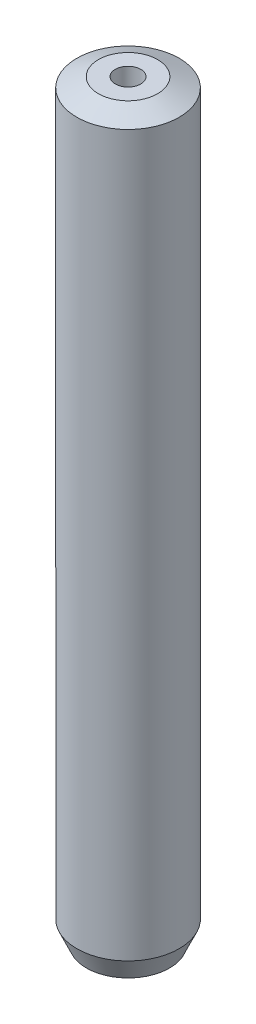
ISO-10303-21;
HEADER;
FILE_DESCRIPTION(('STEP AP214'),'2;1');
FILE_NAME('part.step','',(''),(''),'','','');
FILE_SCHEMA(('AUTOMOTIVE_DESIGN { 1 0 10303 214 1 1 1 1 }'));
ENDSEC;
DATA;
#1=APPLICATION_CONTEXT('core data for automotive mechanical design processes');
#2=APPLICATION_PROTOCOL_DEFINITION('international standard','automotive_design',2000,#1);
#3=PRODUCT_CONTEXT('',#1,'mechanical');
#4=PRODUCT('Part','Part','',(#3));
#5=PRODUCT_RELATED_PRODUCT_CATEGORY('part','',(#4));
#6=PRODUCT_DEFINITION_FORMATION('','',#4);
#7=PRODUCT_DEFINITION_CONTEXT('part definition',#1,'design');
#8=PRODUCT_DEFINITION('design','',#6,#7);
#9=PRODUCT_DEFINITION_SHAPE('','',#8);
#10=(LENGTH_UNIT() NAMED_UNIT(*) SI_UNIT(.MILLI.,.METRE.));
#11=(NAMED_UNIT(*) PLANE_ANGLE_UNIT() SI_UNIT($,.RADIAN.));
#12=(NAMED_UNIT(*) SI_UNIT($,.STERADIAN.) SOLID_ANGLE_UNIT());
#13=UNCERTAINTY_MEASURE_WITH_UNIT(LENGTH_MEASURE(1.E-05),#10,'distance_accuracy_value','');
#14=(GEOMETRIC_REPRESENTATION_CONTEXT(3) GLOBAL_UNCERTAINTY_ASSIGNED_CONTEXT((#13)) GLOBAL_UNIT_ASSIGNED_CONTEXT((#10,
#11,#12)) REPRESENTATION_CONTEXT('',''));
#15=CARTESIAN_POINT('',(0.,0.,0.));
#16=DIRECTION('',(0.,0.,1.));
#17=DIRECTION('',(1.,0.,0.));
#18=AXIS2_PLACEMENT_3D('',#15,#16,#17);
#19=CARTESIAN_POINT('',(0.,110.110370823984,0.));
#20=DIRECTION('',(0.,-1.,0.));
#21=DIRECTION('',(0.,0.,-1.));
#22=AXIS2_PLACEMENT_3D('',#19,#20,#21);
#23=CYLINDRICAL_SURFACE('',#22,7.5);
#24=CARTESIAN_POINT('',(0.,108.703090389656,0.));
#25=DIRECTION('',(0.,1.,0.));
#26=DIRECTION('',(0.,0.,1.));
#27=AXIS2_PLACEMENT_3D('',#24,#25,#26);
#28=CIRCLE('',#27,7.5);
#29=CARTESIAN_POINT('',(0.,108.703090389656,-7.5));
#30=VERTEX_POINT('',#29);
#31=EDGE_CURVE('E50',#30,#30,#28,.F.);
#32=CARTESIAN_POINT('',(0.,3.16153176313021,0.));
#33=DIRECTION('',(0.,1.,0.));
#34=DIRECTION('',(0.,0.,1.));
#35=AXIS2_PLACEMENT_3D('',#32,#33,#34);
#36=CIRCLE('',#35,7.5);
#37=CARTESIAN_POINT('',(0.,3.16153176313021,-7.5));
#38=VERTEX_POINT('',#37);
#39=EDGE_CURVE('E51',#38,#38,#36,.T.);
#40=CARTESIAN_POINT('',(0.,108.703090389656,-7.5));
#41=CARTESIAN_POINT('',(0.,107.603699153963,-7.5));
#42=CARTESIAN_POINT('',(0.,106.50430791827,-7.5));
#43=CARTESIAN_POINT('',(0.,104.305525446884,-7.5));
#44=CARTESIAN_POINT('',(0.,103.206134211191,-7.5));
#45=CARTESIAN_POINT('',(0.,101.007351739805,-7.5));
#46=CARTESIAN_POINT('',(0.,99.9079605041123,-7.5));
#47=CARTESIAN_POINT('',(0.,97.7091780327263,-7.5));
#48=CARTESIAN_POINT('',(0.,96.6097867970334,-7.5));
#49=CARTESIAN_POINT('',(0.,94.4110043256474,-7.5));
#50=CARTESIAN_POINT('',(0.,93.3116130899544,-7.5));
#51=CARTESIAN_POINT('',(0.,91.1128306185685,-7.5));
#52=CARTESIAN_POINT('',(0.,90.0134393828755,-7.5));
#53=CARTESIAN_POINT('',(0.,87.8146569114895,-7.5));
#54=CARTESIAN_POINT('',(0.,86.7152656757966,-7.5));
#55=CARTESIAN_POINT('',(0.,84.5164832044106,-7.5));
#56=CARTESIAN_POINT('',(0.,83.4170919687176,-7.5));
#57=CARTESIAN_POINT('',(0.,81.2183094973317,-7.5));
#58=CARTESIAN_POINT('',(0.,80.1189182616387,-7.5));
#59=CARTESIAN_POINT('',(0.,77.9201357902527,-7.5));
#60=CARTESIAN_POINT('',(0.,76.8207445545598,-7.5));
#61=CARTESIAN_POINT('',(0.,74.6219620831738,-7.5));
#62=CARTESIAN_POINT('',(0.,73.5225708474808,-7.5));
#63=CARTESIAN_POINT('',(0.,71.3237883760949,-7.5));
#64=CARTESIAN_POINT('',(0.,70.2243971404019,-7.5));
#65=CARTESIAN_POINT('',(0.,68.0256146690159,-7.5));
#66=CARTESIAN_POINT('',(0.,66.926223433323,-7.5));
#67=CARTESIAN_POINT('',(0.,64.727440961937,-7.5));
#68=CARTESIAN_POINT('',(0.,63.628049726244,-7.5));
#69=CARTESIAN_POINT('',(0.,61.4292672548581,-7.5));
#70=CARTESIAN_POINT('',(0.,60.3298760191651,-7.5));
#71=CARTESIAN_POINT('',(0.,58.1310935477791,-7.5));
#72=CARTESIAN_POINT('',(0.,57.0317023120861,-7.5));
#73=CARTESIAN_POINT('',(0.,54.8329198407002,-7.5));
#74=CARTESIAN_POINT('',(0.,53.7335286050072,-7.5));
#75=CARTESIAN_POINT('',(0.,51.5347461336213,-7.5));
#76=CARTESIAN_POINT('',(0.,50.4353548979283,-7.5));
#77=CARTESIAN_POINT('',(0.,48.2365724265423,-7.5));
#78=CARTESIAN_POINT('',(0.,47.1371811908493,-7.5));
#79=CARTESIAN_POINT('',(0.,44.9383987194634,-7.5));
#80=CARTESIAN_POINT('',(0.,43.8390074837704,-7.5));
#81=CARTESIAN_POINT('',(0.,41.6402250123845,-7.5));
#82=CARTESIAN_POINT('',(0.,40.5408337766915,-7.5));
#83=CARTESIAN_POINT('',(0.,38.3420513053055,-7.5));
#84=CARTESIAN_POINT('',(0.,37.2426600696125,-7.5));
#85=CARTESIAN_POINT('',(0.,35.0438775982266,-7.5));
#86=CARTESIAN_POINT('',(0.,33.9444863625336,-7.5));
#87=CARTESIAN_POINT('',(0.,31.7457038911476,-7.5));
#88=CARTESIAN_POINT('',(0.,30.6463126554547,-7.5));
#89=CARTESIAN_POINT('',(0.,28.4475301840687,-7.5));
#90=CARTESIAN_POINT('',(0.,27.3481389483757,-7.5));
#91=CARTESIAN_POINT('',(0.,25.1493564769898,-7.5));
#92=CARTESIAN_POINT('',(0.,24.0499652412968,-7.5));
#93=CARTESIAN_POINT('',(0.,21.8511827699108,-7.5));
#94=CARTESIAN_POINT('',(0.,20.7517915342179,-7.5));
#95=CARTESIAN_POINT('',(0.,18.5530090628319,-7.5));
#96=CARTESIAN_POINT('',(0.,17.4536178271389,-7.5));
#97=CARTESIAN_POINT('',(0.,15.254835355753,-7.5));
#98=CARTESIAN_POINT('',(0.,14.15544412006,-7.5));
#99=CARTESIAN_POINT('',(0.,11.956661648674,-7.5));
#100=CARTESIAN_POINT('',(0.,10.8572704129811,-7.5));
#101=CARTESIAN_POINT('',(0.,8.65848794159511,-7.5));
#102=CARTESIAN_POINT('',(0.,7.55909670590213,-7.5));
#103=CARTESIAN_POINT('',(0.,5.36031423451617,-7.5));
#104=CARTESIAN_POINT('',(0.,4.26092299882318,-7.5));
#105=CARTESIAN_POINT('',(0.,3.16153176313021,-7.5));
#106=B_SPLINE_CURVE_WITH_KNOTS('',3,(#40,#41,#42,#43,#44,#45,#46,#47,#48,#49,#50,#51,#52,#53,
#54,#55,#56,#57,#58,#59,#60,#61,#62,#63,#64,#65,#66,#67,#68,#69,#70,#71,#72,#73,#74,#75,#76,#77,
#78,#79,#80,#81,#82,#83,#84,#85,#86,#87,#88,#89,#90,#91,#92,#93,#94,#95,#96,#97,#98,#99,#100,
#101,#102,#103,#104,#105),.UNSPECIFIED.,.F.,.F.,(4,2,2,2,2,2,2,2,2,2,2,2,2,2,2,2,2,2,2,2,2,2,2,
2,2,2,2,2,2,2,2,2,4),(0.,3.29817370707894,6.59634741415788,9.89452112123682,13.1926948283157,
16.4908685353947,19.7890422424736,23.0872159495526,26.3853896566315,29.6835633637104,
32.9817370707893,36.2799107778683,39.5780844849472,42.8762581920262,46.1744318991051,
49.472605606184,52.770779313263,56.0689530203419,59.3671267274208,62.6653004344997,
65.9634741415787,69.2616478486576,72.5598215557366,75.8579952628155,79.1561689698944,
82.4543426769734,85.7525163840523,89.0506900911312,92.3488637982102,95.6470375052891,
98.9452112123681,102.243384919447,105.541558626526),.UNSPECIFIED.);
#107=EDGE_CURVE('BSEAM39',#30,#38,#106,.T.);
#108=ORIENTED_EDGE('',*,*,#31,.T.);
#109=ORIENTED_EDGE('',*,*,#39,.T.);
#110=ORIENTED_EDGE('',*,*,#107,.T.);
#111=ORIENTED_EDGE('',*,*,#107,.F.);
#112=EDGE_LOOP('',(#108,#110,#109,#111));
#113=FACE_BOUND('',#112,.T.);
#114=ADVANCED_FACE('F39',(#113),#23,.T.);
#115=CARTESIAN_POINT('',(0.,110.110370823984,0.));
#116=DIRECTION('',(0.,1.,0.));
#117=DIRECTION('',(0.,0.,1.));
#118=AXIS2_PLACEMENT_3D('',#115,#116,#117);
#119=PLANE('',#118);
#120=CARTESIAN_POINT('',(0.,110.110370823984,0.));
#121=DIRECTION('',(0.,1.,0.));
#122=DIRECTION('',(0.,0.,1.));
#123=AXIS2_PLACEMENT_3D('',#120,#121,#122);
#124=CIRCLE('',#123,4.33846823687019);
#125=CARTESIAN_POINT('',(0.,110.110370823984,4.33846823687019));
#126=VERTEX_POINT('',#125);
#127=EDGE_CURVE('E54',#126,#126,#124,.T.);
#128=ORIENTED_EDGE('',*,*,#127,.T.);
#129=EDGE_LOOP('',(#128));
#130=FACE_BOUND('',#129,.T.);
#131=CARTESIAN_POINT('',(0.,110.110370823984,0.));
#132=DIRECTION('',(0.,1.,0.));
#133=DIRECTION('',(0.,0.,1.));
#134=AXIS2_PLACEMENT_3D('',#131,#132,#133);
#135=CIRCLE('',#134,1.86861629184657);
#136=CARTESIAN_POINT('',(0.,110.110370823984,-1.86861629184657));
#137=VERTEX_POINT('',#136);
#138=EDGE_CURVE('E58',#137,#137,#135,.T.);
#139=ORIENTED_EDGE('',*,*,#138,.F.);
#140=EDGE_LOOP('',(#139));
#141=FACE_BOUND('',#140,.T.);
#142=ADVANCED_FACE('F69',(#130,#141),#119,.T.);
#143=CARTESIAN_POINT('',(0.,0.,0.));
#144=DIRECTION('',(0.,1.,0.));
#145=DIRECTION('',(0.,0.,1.));
#146=AXIS2_PLACEMENT_3D('',#143,#144,#145);
#147=PLANE('',#146);
#148=CARTESIAN_POINT('',(0.,0.,0.));
#149=DIRECTION('',(0.,1.,0.));
#150=DIRECTION('',(0.,0.,1.));
#151=AXIS2_PLACEMENT_3D('',#148,#149,#150);
#152=CIRCLE('',#151,6.09271956567148);
#153=CARTESIAN_POINT('',(0.,0.,6.09271956567148));
#154=VERTEX_POINT('',#153);
#155=EDGE_CURVE('E10',#154,#154,#152,.F.);
#156=ORIENTED_EDGE('',*,*,#155,.T.);
#157=EDGE_LOOP('',(#156));
#158=FACE_BOUND('',#157,.T.);
#159=CARTESIAN_POINT('',(0.,0.,0.));
#160=DIRECTION('',(0.,1.,0.));
#161=DIRECTION('',(0.,0.,1.));
#162=AXIS2_PLACEMENT_3D('',#159,#160,#161);
#163=CIRCLE('',#162,1.86861629184657);
#164=CARTESIAN_POINT('',(0.,0.,-1.86861629184657));
#165=VERTEX_POINT('',#164);
#166=EDGE_CURVE('E63',#165,#165,#163,.T.);
#167=ORIENTED_EDGE('',*,*,#166,.T.);
#168=EDGE_LOOP('',(#167));
#169=FACE_BOUND('',#168,.T.);
#170=ADVANCED_FACE('F75',(#158,#169),#147,.F.);
#171=CARTESIAN_POINT('',(0.,110.110370823984,0.));
#172=DIRECTION('',(0.,-1.,0.));
#173=DIRECTION('',(0.,0.,-1.));
#174=AXIS2_PLACEMENT_3D('',#171,#172,#173);
#175=CYLINDRICAL_SURFACE('',#174,1.86861629184657);
#176=CARTESIAN_POINT('',(0.,110.110370823984,-1.86861629184657));
#177=CARTESIAN_POINT('',(0.,108.963387794568,-1.86861629184657));
#178=CARTESIAN_POINT('',(0.,107.816404765151,-1.86861629184657));
#179=CARTESIAN_POINT('',(0.,105.522438706318,-1.86861629184657));
#180=CARTESIAN_POINT('',(0.,104.375455676902,-1.86861629184657));
#181=CARTESIAN_POINT('',(0.,102.081489618069,-1.86861629184657));
#182=CARTESIAN_POINT('',(0.,100.934506588652,-1.86861629184657));
#183=CARTESIAN_POINT('',(0.,98.6405405298194,-1.86861629184657));
#184=CARTESIAN_POINT('',(0.,97.4935575004029,-1.86861629184657));
#185=CARTESIAN_POINT('',(0.,95.1995914415699,-1.86861629184657));
#186=CARTESIAN_POINT('',(0.,94.0526084121534,-1.86861629184657));
#187=CARTESIAN_POINT('',(0.,91.7586423533204,-1.86861629184657));
#188=CARTESIAN_POINT('',(0.,90.6116593239039,-1.86861629184657));
#189=CARTESIAN_POINT('',(0.,88.3176932650709,-1.86861629184657));
#190=CARTESIAN_POINT('',(0.,87.1707102356544,-1.86861629184657));
#191=CARTESIAN_POINT('',(0.,84.8767441768214,-1.86861629184657));
#192=CARTESIAN_POINT('',(0.,83.7297611474049,-1.86861629184657));
#193=CARTESIAN_POINT('',(0.,81.4357950885719,-1.86861629184657));
#194=CARTESIAN_POINT('',(0.,80.2888120591553,-1.86861629184657));
#195=CARTESIAN_POINT('',(0.,77.9948460003223,-1.86861629184657));
#196=CARTESIAN_POINT('',(0.,76.8478629709058,-1.86861629184657));
#197=CARTESIAN_POINT('',(0.,74.5538969120728,-1.86861629184657));
#198=CARTESIAN_POINT('',(0.,73.4069138826563,-1.86861629184657));
#199=CARTESIAN_POINT('',(0.,71.1129478238233,-1.86861629184657));
#200=CARTESIAN_POINT('',(0.,69.9659647944068,-1.86861629184657));
#201=CARTESIAN_POINT('',(0.,67.6719987355738,-1.86861629184657));
#202=CARTESIAN_POINT('',(0.,66.5250157061573,-1.86861629184657));
#203=CARTESIAN_POINT('',(0.,64.2310496473243,-1.86861629184657));
#204=CARTESIAN_POINT('',(0.,63.0840666179078,-1.86861629184657));
#205=CARTESIAN_POINT('',(0.,60.7901005590748,-1.86861629184657));
#206=CARTESIAN_POINT('',(0.,59.6431175296582,-1.86861629184657));
#207=CARTESIAN_POINT('',(0.,57.3491514708252,-1.86861629184657));
#208=CARTESIAN_POINT('',(0.,56.2021684414087,-1.86861629184657));
#209=CARTESIAN_POINT('',(0.,53.9082023825757,-1.86861629184657));
#210=CARTESIAN_POINT('',(0.,52.7612193531592,-1.86861629184657));
#211=CARTESIAN_POINT('',(0.,50.4672532943262,-1.86861629184657));
#212=CARTESIAN_POINT('',(0.,49.3202702649097,-1.86861629184657));
#213=CARTESIAN_POINT('',(0.,47.0263042060767,-1.86861629184657));
#214=CARTESIAN_POINT('',(0.,45.8793211766602,-1.86861629184657));
#215=CARTESIAN_POINT('',(0.,43.5853551178272,-1.86861629184657));
#216=CARTESIAN_POINT('',(0.,42.4383720884107,-1.86861629184657));
#217=CARTESIAN_POINT('',(0.,40.1444060295777,-1.86861629184657));
#218=CARTESIAN_POINT('',(0.,38.9974230001612,-1.86861629184657));
#219=CARTESIAN_POINT('',(0.,36.7034569413282,-1.86861629184657));
#220=CARTESIAN_POINT('',(0.,35.5564739119117,-1.86861629184657));
#221=CARTESIAN_POINT('',(0.,33.2625078530786,-1.86861629184657));
#222=CARTESIAN_POINT('',(0.,32.1155248236621,-1.86861629184657));
#223=CARTESIAN_POINT('',(0.,29.8215587648291,-1.86861629184657));
#224=CARTESIAN_POINT('',(0.,28.6745757354126,-1.86861629184657));
#225=CARTESIAN_POINT('',(0.,26.3806096765796,-1.86861629184657));
#226=CARTESIAN_POINT('',(0.,25.2336266471631,-1.86861629184657));
#227=CARTESIAN_POINT('',(0.,22.9396605883301,-1.86861629184657));
#228=CARTESIAN_POINT('',(0.,21.7926775589136,-1.86861629184657));
#229=CARTESIAN_POINT('',(0.,19.4987115000806,-1.86861629184657));
#230=CARTESIAN_POINT('',(0.,18.3517284706641,-1.86861629184657));
#231=CARTESIAN_POINT('',(0.,16.0577624118311,-1.86861629184657));
#232=CARTESIAN_POINT('',(0.,14.9107793824146,-1.86861629184657));
#233=CARTESIAN_POINT('',(0.,12.6168133235815,-1.86861629184657));
#234=CARTESIAN_POINT('',(0.,11.469830294165,-1.86861629184657));
#235=CARTESIAN_POINT('',(0.,9.17586423533203,-1.86861629184657));
#236=CARTESIAN_POINT('',(0.,8.02888120591553,-1.86861629184657));
#237=CARTESIAN_POINT('',(0.,5.73491514708252,-1.86861629184657));
#238=CARTESIAN_POINT('',(0.,4.58793211766601,-1.86861629184657));
#239=CARTESIAN_POINT('',(0.,2.293966058833,-1.86861629184657));
#240=CARTESIAN_POINT('',(0.,1.14698302941649,-1.86861629184657));
#241=CARTESIAN_POINT('',(0.,0.,-1.86861629184657));
#242=B_SPLINE_CURVE_WITH_KNOTS('',3,(#176,#177,#178,#179,#180,#181,#182,#183,#184,#185,#186,
#187,#188,#189,#190,#191,#192,#193,#194,#195,#196,#197,#198,#199,#200,#201,#202,#203,#204,#205,
#206,#207,#208,#209,#210,#211,#212,#213,#214,#215,#216,#217,#218,#219,#220,#221,#222,#223,#224,
#225,#226,#227,#228,#229,#230,#231,#232,#233,#234,#235,#236,#237,#238,#239,#240,#241),
.UNSPECIFIED.,.F.,.F.,(4,2,2,2,2,2,2,2,2,2,2,2,2,2,2,2,2,2,2,2,2,2,2,2,2,2,2,2,2,2,2,2,4),(0.,
3.44094908824952,6.88189817649904,10.3228472647486,13.7637963529981,17.2047454412476,
20.6456945294971,24.0866436177466,27.5275927059961,30.9685417942456,34.4094908824952,
37.8504399707447,41.2913890589942,44.7323381472437,48.1732872354932,51.6142363237427,
55.0551854119923,58.4961345002418,61.9370835884913,65.3780326767408,68.8189817649903,
72.2599308532398,75.7008799414893,79.1418290297388,82.5827781179884,86.0237272062379,
89.4646762944874,92.9056253827369,96.3465744709864,99.7875235592359,103.228472647485,
106.669421735735,110.110370823984),.UNSPECIFIED.);
#243=EDGE_CURVE('BSEAM70',#137,#165,#242,.T.);
#244=ORIENTED_EDGE('',*,*,#138,.T.);
#245=ORIENTED_EDGE('',*,*,#166,.F.);
#246=ORIENTED_EDGE('',*,*,#243,.T.);
#247=ORIENTED_EDGE('',*,*,#243,.F.);
#248=EDGE_LOOP('',(#244,#246,#245,#247));
#249=FACE_BOUND('',#248,.T.);
#250=ADVANCED_FACE('F70',(#249),#175,.F.);
#251=CARTESIAN_POINT('',(0.,110.110370823984,0.));
#252=DIRECTION('',(0.,-1.,0.));
#253=DIRECTION('',(0.,0.,-1.));
#254=AXIS2_PLACEMENT_3D('',#251,#252,#253);
#255=CONICAL_SURFACE('',#254,4.33846823687019,1.15200288924617);
#256=ORIENTED_EDGE('',*,*,#31,.F.);
#257=EDGE_LOOP('',(#256));
#258=FACE_BOUND('',#257,.T.);
#259=ORIENTED_EDGE('',*,*,#127,.F.);
#260=EDGE_LOOP('',(#259));
#261=FACE_BOUND('',#260,.T.);
#262=ADVANCED_FACE('F81',(#258,#261),#255,.T.);
#263=CARTESIAN_POINT('',(0.,3.16153176313021,0.));
#264=DIRECTION('',(0.,1.,0.));
#265=DIRECTION('',(0.,0.,1.));
#266=AXIS2_PLACEMENT_3D('',#263,#264,#265);
#267=CONICAL_SURFACE('',#266,7.5,0.418793437548722);
#268=ORIENTED_EDGE('',*,*,#155,.F.);
#269=EDGE_LOOP('',(#268));
#270=FACE_BOUND('',#269,.T.);
#271=ORIENTED_EDGE('',*,*,#39,.F.);
#272=EDGE_LOOP('',(#271));
#273=FACE_BOUND('',#272,.T.);
#274=ADVANCED_FACE('F45',(#270,#273),#267,.T.);
#275=CLOSED_SHELL('',(#114,#142,#170,#250,#262,#274));
#276=MANIFOLD_SOLID_BREP('B2',#275);
#277=ADVANCED_BREP_SHAPE_REPRESENTATION('',(#18,#276),#14);
#278=SHAPE_DEFINITION_REPRESENTATION(#9,#277);
ENDSEC;
END-ISO-10303-21;
